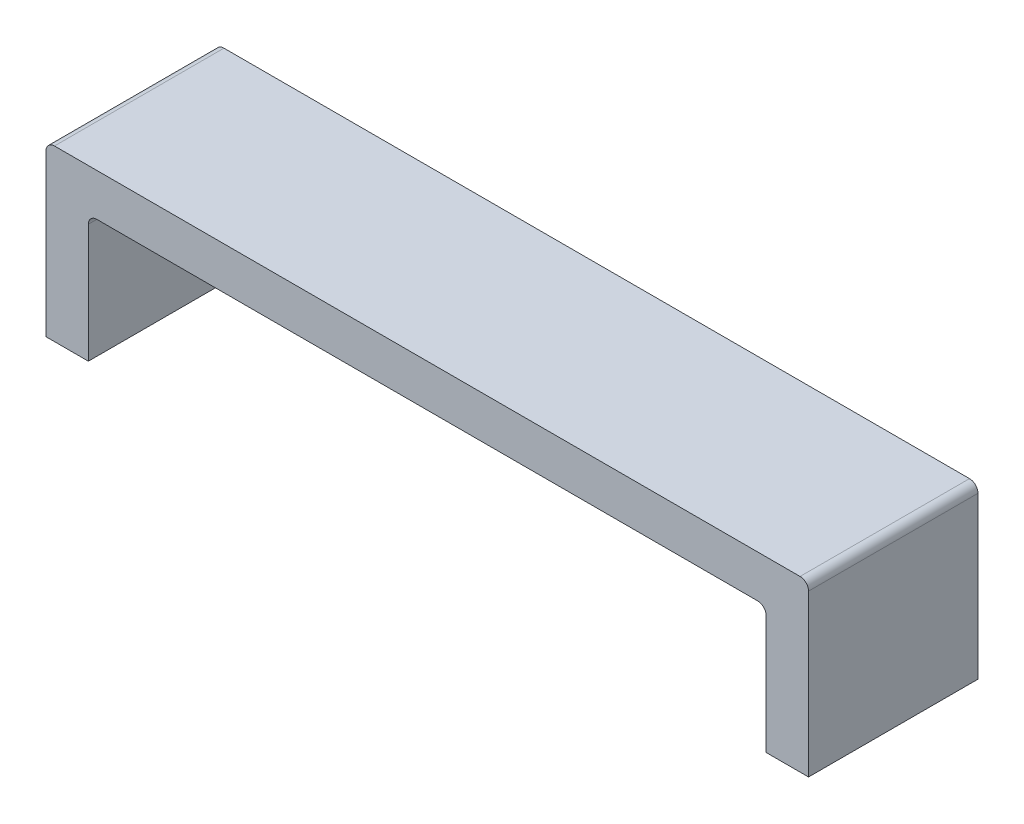
ISO-10303-21;
HEADER;
FILE_DESCRIPTION(('STEP AP214'),'2;1');
FILE_NAME('part.step','',(''),(''),'','','');
FILE_SCHEMA(('AUTOMOTIVE_DESIGN { 1 0 10303 214 1 1 1 1 }'));
ENDSEC;
DATA;
#1=APPLICATION_CONTEXT('core data for automotive mechanical design processes');
#2=APPLICATION_PROTOCOL_DEFINITION('international standard','automotive_design',2000,#1);
#3=PRODUCT_CONTEXT('',#1,'mechanical');
#4=PRODUCT('Part','Part','',(#3));
#5=PRODUCT_RELATED_PRODUCT_CATEGORY('part','',(#4));
#6=PRODUCT_DEFINITION_FORMATION('','',#4);
#7=PRODUCT_DEFINITION_CONTEXT('part definition',#1,'design');
#8=PRODUCT_DEFINITION('design','',#6,#7);
#9=PRODUCT_DEFINITION_SHAPE('','',#8);
#10=(LENGTH_UNIT() NAMED_UNIT(*) SI_UNIT(.MILLI.,.METRE.));
#11=(NAMED_UNIT(*) PLANE_ANGLE_UNIT() SI_UNIT($,.RADIAN.));
#12=(NAMED_UNIT(*) SI_UNIT($,.STERADIAN.) SOLID_ANGLE_UNIT());
#13=UNCERTAINTY_MEASURE_WITH_UNIT(LENGTH_MEASURE(1.E-05),#10,'distance_accuracy_value','');
#14=(GEOMETRIC_REPRESENTATION_CONTEXT(3) GLOBAL_UNCERTAINTY_ASSIGNED_CONTEXT((#13)) GLOBAL_UNIT_ASSIGNED_CONTEXT((#10,
#11,#12)) REPRESENTATION_CONTEXT('',''));
#15=CARTESIAN_POINT('',(0.,0.,0.));
#16=DIRECTION('',(0.,0.,1.));
#17=DIRECTION('',(1.,0.,0.));
#18=AXIS2_PLACEMENT_3D('',#15,#16,#17);
#19=CARTESIAN_POINT('',(25.4,0.,101.6));
#20=DIRECTION('',(0.,1.,0.));
#21=DIRECTION('',(-1.,0.,0.));
#22=AXIS2_PLACEMENT_3D('',#19,#20,#21);
#23=PLANE('',#22);
#24=DIRECTION('',(1.,0.,0.));
#25=VECTOR('',#24,1.);
#26=CARTESIAN_POINT('',(25.4,0.,0.));
#27=LINE('',#26,#25);
#28=CARTESIAN_POINT('',(0.,0.,0.));
#29=VERTEX_POINT('',#28);
#30=CARTESIAN_POINT('',(25.4,0.,0.));
#31=VERTEX_POINT('',#30);
#32=EDGE_CURVE('E161',#29,#31,#27,.T.);
#33=ORIENTED_EDGE('',*,*,#32,.T.);
#34=DIRECTION('',(0.,0.,-1.));
#35=VECTOR('',#34,1.);
#36=CARTESIAN_POINT('',(25.4,0.,101.6));
#37=LINE('',#36,#35);
#38=CARTESIAN_POINT('',(25.4,0.,101.6));
#39=VERTEX_POINT('',#38);
#40=EDGE_CURVE('E142',#39,#31,#37,.T.);
#41=ORIENTED_EDGE('',*,*,#40,.F.);
#42=DIRECTION('',(1.,0.,0.));
#43=VECTOR('',#42,1.);
#44=CARTESIAN_POINT('',(25.4,0.,101.6));
#45=LINE('',#44,#43);
#46=CARTESIAN_POINT('',(0.,0.,101.6));
#47=VERTEX_POINT('',#46);
#48=EDGE_CURVE('E149',#47,#39,#45,.T.);
#49=ORIENTED_EDGE('',*,*,#48,.F.);
#50=DIRECTION('',(0.,0.,-1.));
#51=VECTOR('',#50,1.);
#52=CARTESIAN_POINT('',(0.,0.,101.6));
#53=LINE('',#52,#51);
#54=EDGE_CURVE('E249',#47,#29,#53,.T.);
#55=ORIENTED_EDGE('',*,*,#54,.T.);
#56=EDGE_LOOP('',(#33,#41,#49,#55));
#57=FACE_BOUND('',#56,.T.);
#58=ADVANCED_FACE('F45',(#57),#23,.F.);
#59=CARTESIAN_POINT('',(25.4,76.1999999999999,101.6));
#60=DIRECTION('',(-1.,0.,0.));
#61=DIRECTION('',(0.,-1.,0.));
#62=AXIS2_PLACEMENT_3D('',#59,#60,#61);
#63=PLANE('',#62);
#64=DIRECTION('',(0.,1.,0.));
#65=VECTOR('',#64,1.);
#66=CARTESIAN_POINT('',(25.4,76.1999999999999,0.));
#67=LINE('',#66,#65);
#68=CARTESIAN_POINT('',(25.4,71.1199999999999,0.));
#69=VERTEX_POINT('',#68);
#70=EDGE_CURVE('E218',#31,#69,#67,.T.);
#71=ORIENTED_EDGE('',*,*,#70,.T.);
#72=DIRECTION('',(0.,0.,-1.));
#73=VECTOR('',#72,1.);
#74=CARTESIAN_POINT('',(25.4,71.1199999999999,101.6));
#75=LINE('',#74,#73);
#76=CARTESIAN_POINT('',(25.4,71.1199999999999,101.6));
#77=VERTEX_POINT('',#76);
#78=EDGE_CURVE('E145',#69,#77,#75,.F.);
#79=ORIENTED_EDGE('',*,*,#78,.T.);
#80=DIRECTION('',(0.,1.,0.));
#81=VECTOR('',#80,1.);
#82=CARTESIAN_POINT('',(25.4,76.1999999999999,101.6));
#83=LINE('',#82,#81);
#84=EDGE_CURVE('E137',#39,#77,#83,.T.);
#85=ORIENTED_EDGE('',*,*,#84,.F.);
#86=ORIENTED_EDGE('',*,*,#40,.T.);
#87=EDGE_LOOP('',(#71,#79,#85,#86));
#88=FACE_BOUND('',#87,.T.);
#89=ADVANCED_FACE('F140',(#88),#63,.F.);
#90=CARTESIAN_POINT('',(431.8,76.2,101.6));
#91=DIRECTION('',(0.,1.,0.));
#92=DIRECTION('',(-1.,0.,0.));
#93=AXIS2_PLACEMENT_3D('',#90,#91,#92);
#94=PLANE('',#93);
#95=DIRECTION('',(1.,0.,0.));
#96=VECTOR('',#95,1.);
#97=CARTESIAN_POINT('',(431.8,76.2,0.));
#98=LINE('',#97,#96);
#99=CARTESIAN_POINT('',(30.48,76.1999999999999,0.));
#100=VERTEX_POINT('',#99);
#101=CARTESIAN_POINT('',(426.72,76.2,0.));
#102=VERTEX_POINT('',#101);
#103=EDGE_CURVE('E220',#100,#102,#98,.T.);
#104=ORIENTED_EDGE('',*,*,#103,.T.);
#105=DIRECTION('',(0.,0.,-1.));
#106=VECTOR('',#105,1.);
#107=CARTESIAN_POINT('',(426.72,76.2,101.6));
#108=LINE('',#107,#106);
#109=CARTESIAN_POINT('',(426.72,76.2,101.6));
#110=VERTEX_POINT('',#109);
#111=EDGE_CURVE('E179',#102,#110,#108,.F.);
#112=ORIENTED_EDGE('',*,*,#111,.T.);
#113=DIRECTION('',(1.,0.,0.));
#114=VECTOR('',#113,1.);
#115=CARTESIAN_POINT('',(431.8,76.2,101.6));
#116=LINE('',#115,#114);
#117=CARTESIAN_POINT('',(30.48,76.1999999999999,101.6));
#118=VERTEX_POINT('',#117);
#119=EDGE_CURVE('E148',#118,#110,#116,.T.);
#120=ORIENTED_EDGE('',*,*,#119,.F.);
#121=DIRECTION('',(0.,0.,-1.));
#122=VECTOR('',#121,1.);
#123=CARTESIAN_POINT('',(30.48,76.1999999999999,0.));
#124=LINE('',#123,#122);
#125=EDGE_CURVE('E169',#118,#100,#124,.T.);
#126=ORIENTED_EDGE('',*,*,#125,.T.);
#127=EDGE_LOOP('',(#104,#112,#120,#126));
#128=FACE_BOUND('',#127,.T.);
#129=ADVANCED_FACE('F230',(#128),#94,.F.);
#130=CARTESIAN_POINT('',(431.8,76.2,101.6));
#131=DIRECTION('',(1.,0.,0.));
#132=DIRECTION('',(0.,0.,-1.));
#133=AXIS2_PLACEMENT_3D('',#130,#131,#132);
#134=PLANE('',#133);
#135=DIRECTION('',(0.,-1.,0.));
#136=VECTOR('',#135,1.);
#137=CARTESIAN_POINT('',(431.8,76.2,101.6));
#138=LINE('',#137,#136);
#139=CARTESIAN_POINT('',(431.8,71.12,101.6));
#140=VERTEX_POINT('',#139);
#141=CARTESIAN_POINT('',(431.8,0.,101.6));
#142=VERTEX_POINT('',#141);
#143=EDGE_CURVE('E233',#140,#142,#138,.T.);
#144=ORIENTED_EDGE('',*,*,#143,.F.);
#145=DIRECTION('',(0.,0.,-1.));
#146=VECTOR('',#145,1.);
#147=CARTESIAN_POINT('',(431.8,71.12,0.));
#148=LINE('',#147,#146);
#149=CARTESIAN_POINT('',(431.8,71.12,0.));
#150=VERTEX_POINT('',#149);
#151=EDGE_CURVE('E163',#140,#150,#148,.T.);
#152=ORIENTED_EDGE('',*,*,#151,.T.);
#153=DIRECTION('',(0.,-1.,0.));
#154=VECTOR('',#153,1.);
#155=CARTESIAN_POINT('',(431.8,76.2,0.));
#156=LINE('',#155,#154);
#157=CARTESIAN_POINT('',(431.8,0.,0.));
#158=VERTEX_POINT('',#157);
#159=EDGE_CURVE('E254',#150,#158,#156,.T.);
#160=ORIENTED_EDGE('',*,*,#159,.T.);
#161=DIRECTION('',(0.,0.,-1.));
#162=VECTOR('',#161,1.);
#163=CARTESIAN_POINT('',(431.8,0.,101.6));
#164=LINE('',#163,#162);
#165=EDGE_CURVE('E164',#142,#158,#164,.T.);
#166=ORIENTED_EDGE('',*,*,#165,.F.);
#167=EDGE_LOOP('',(#144,#152,#160,#166));
#168=FACE_BOUND('',#167,.T.);
#169=ADVANCED_FACE('F379',(#168),#134,.F.);
#170=CARTESIAN_POINT('',(431.8,0.,101.6));
#171=DIRECTION('',(0.,1.,0.));
#172=DIRECTION('',(-1.,0.,0.));
#173=AXIS2_PLACEMENT_3D('',#170,#171,#172);
#174=PLANE('',#173);
#175=DIRECTION('',(1.,0.,0.));
#176=VECTOR('',#175,1.);
#177=CARTESIAN_POINT('',(431.8,0.,0.));
#178=LINE('',#177,#176);
#179=CARTESIAN_POINT('',(457.2,0.,0.));
#180=VERTEX_POINT('',#179);
#181=EDGE_CURVE('E257',#158,#180,#178,.T.);
#182=ORIENTED_EDGE('',*,*,#181,.T.);
#183=DIRECTION('',(0.,0.,-1.));
#184=VECTOR('',#183,1.);
#185=CARTESIAN_POINT('',(457.2,0.,101.6));
#186=LINE('',#185,#184);
#187=CARTESIAN_POINT('',(457.2,0.,101.6));
#188=VERTEX_POINT('',#187);
#189=EDGE_CURVE('E172',#188,#180,#186,.T.);
#190=ORIENTED_EDGE('',*,*,#189,.F.);
#191=DIRECTION('',(1.,0.,0.));
#192=VECTOR('',#191,1.);
#193=CARTESIAN_POINT('',(431.8,0.,101.6));
#194=LINE('',#193,#192);
#195=EDGE_CURVE('E236',#142,#188,#194,.T.);
#196=ORIENTED_EDGE('',*,*,#195,.F.);
#197=ORIENTED_EDGE('',*,*,#165,.T.);
#198=EDGE_LOOP('',(#182,#190,#196,#197));
#199=FACE_BOUND('',#198,.T.);
#200=ADVANCED_FACE('F370',(#199),#174,.F.);
#201=CARTESIAN_POINT('',(457.2,0.,101.6));
#202=DIRECTION('',(-1.,0.,0.));
#203=DIRECTION('',(0.,0.,1.));
#204=AXIS2_PLACEMENT_3D('',#201,#202,#203);
#205=PLANE('',#204);
#206=DIRECTION('',(0.,1.,0.));
#207=VECTOR('',#206,1.);
#208=CARTESIAN_POINT('',(457.2,0.,0.));
#209=LINE('',#208,#207);
#210=CARTESIAN_POINT('',(457.2,96.52,0.));
#211=VERTEX_POINT('',#210);
#212=EDGE_CURVE('E260',#180,#211,#209,.T.);
#213=ORIENTED_EDGE('',*,*,#212,.T.);
#214=DIRECTION('',(0.,0.,-1.));
#215=VECTOR('',#214,1.);
#216=CARTESIAN_POINT('',(457.2,96.52,101.6));
#217=LINE('',#216,#215);
#218=CARTESIAN_POINT('',(457.2,96.52,101.6));
#219=VERTEX_POINT('',#218);
#220=EDGE_CURVE('E69',#211,#219,#217,.F.);
#221=ORIENTED_EDGE('',*,*,#220,.T.);
#222=DIRECTION('',(0.,1.,0.));
#223=VECTOR('',#222,1.);
#224=CARTESIAN_POINT('',(457.2,0.,101.6));
#225=LINE('',#224,#223);
#226=EDGE_CURVE('E241',#188,#219,#225,.T.);
#227=ORIENTED_EDGE('',*,*,#226,.F.);
#228=ORIENTED_EDGE('',*,*,#189,.T.);
#229=EDGE_LOOP('',(#213,#221,#227,#228));
#230=FACE_BOUND('',#229,.T.);
#231=ADVANCED_FACE('F274',(#230),#205,.F.);
#232=CARTESIAN_POINT('',(0.,101.6,101.6));
#233=DIRECTION('',(0.,-1.,0.));
#234=DIRECTION('',(0.,0.,-1.));
#235=AXIS2_PLACEMENT_3D('',#232,#233,#234);
#236=PLANE('',#235);
#237=DIRECTION('',(-1.,0.,0.));
#238=VECTOR('',#237,1.);
#239=CARTESIAN_POINT('',(0.,101.6,101.6));
#240=LINE('',#239,#238);
#241=CARTESIAN_POINT('',(452.12,101.6,101.6));
#242=VERTEX_POINT('',#241);
#243=CARTESIAN_POINT('',(5.08,101.6,101.6));
#244=VERTEX_POINT('',#243);
#245=EDGE_CURVE('E244',#242,#244,#240,.T.);
#246=ORIENTED_EDGE('',*,*,#245,.F.);
#247=DIRECTION('',(0.,0.,-1.));
#248=VECTOR('',#247,1.);
#249=CARTESIAN_POINT('',(452.12,101.6,101.6));
#250=LINE('',#249,#248);
#251=CARTESIAN_POINT('',(452.12,101.6,0.));
#252=VERTEX_POINT('',#251);
#253=EDGE_CURVE('E187',#242,#252,#250,.T.);
#254=ORIENTED_EDGE('',*,*,#253,.T.);
#255=DIRECTION('',(-1.,0.,0.));
#256=VECTOR('',#255,1.);
#257=CARTESIAN_POINT('',(0.,101.6,0.));
#258=LINE('',#257,#256);
#259=CARTESIAN_POINT('',(5.08,101.6,0.));
#260=VERTEX_POINT('',#259);
#261=EDGE_CURVE('E263',#252,#260,#258,.T.);
#262=ORIENTED_EDGE('',*,*,#261,.T.);
#263=DIRECTION('',(0.,0.,-1.));
#264=VECTOR('',#263,1.);
#265=CARTESIAN_POINT('',(5.08,101.6,101.6));
#266=LINE('',#265,#264);
#267=EDGE_CURVE('E184',#260,#244,#266,.F.);
#268=ORIENTED_EDGE('',*,*,#267,.T.);
#269=EDGE_LOOP('',(#246,#254,#262,#268));
#270=FACE_BOUND('',#269,.T.);
#271=ADVANCED_FACE('F285',(#270),#236,.F.);
#272=CARTESIAN_POINT('',(0.,0.,101.6));
#273=DIRECTION('',(1.,0.,0.));
#274=DIRECTION('',(0.,0.,-1.));
#275=AXIS2_PLACEMENT_3D('',#272,#273,#274);
#276=PLANE('',#275);
#277=DIRECTION('',(0.,-1.,0.));
#278=VECTOR('',#277,1.);
#279=CARTESIAN_POINT('',(0.,0.,101.6));
#280=LINE('',#279,#278);
#281=CARTESIAN_POINT('',(0.,96.52,101.6));
#282=VERTEX_POINT('',#281);
#283=EDGE_CURVE('E153',#282,#47,#280,.T.);
#284=ORIENTED_EDGE('',*,*,#283,.F.);
#285=DIRECTION('',(0.,0.,-1.));
#286=VECTOR('',#285,1.);
#287=CARTESIAN_POINT('',(0.,96.52,101.6));
#288=LINE('',#287,#286);
#289=CARTESIAN_POINT('',(0.,96.52,0.));
#290=VERTEX_POINT('',#289);
#291=EDGE_CURVE('E204',#282,#290,#288,.T.);
#292=ORIENTED_EDGE('',*,*,#291,.T.);
#293=DIRECTION('',(0.,-1.,0.));
#294=VECTOR('',#293,1.);
#295=CARTESIAN_POINT('',(0.,0.,0.));
#296=LINE('',#295,#294);
#297=EDGE_CURVE('E158',#290,#29,#296,.T.);
#298=ORIENTED_EDGE('',*,*,#297,.T.);
#299=ORIENTED_EDGE('',*,*,#54,.F.);
#300=EDGE_LOOP('',(#284,#292,#298,#299));
#301=FACE_BOUND('',#300,.T.);
#302=ADVANCED_FACE('F291',(#301),#276,.F.);
#303=CARTESIAN_POINT('',(0.,0.,101.6));
#304=DIRECTION('',(0.,0.,-1.));
#305=DIRECTION('',(-1.,0.,0.));
#306=AXIS2_PLACEMENT_3D('',#303,#304,#305);
#307=PLANE('',#306);
#308=ORIENTED_EDGE('',*,*,#226,.T.);
#309=CARTESIAN_POINT('',(452.12,96.52,101.6));
#310=DIRECTION('',(0.,0.,-1.));
#311=DIRECTION('',(-1.,0.,0.));
#312=AXIS2_PLACEMENT_3D('',#309,#310,#311);
#313=CIRCLE('',#312,5.08);
#314=EDGE_CURVE('E201',#219,#242,#313,.F.);
#315=ORIENTED_EDGE('',*,*,#314,.T.);
#316=ORIENTED_EDGE('',*,*,#245,.T.);
#317=CARTESIAN_POINT('',(5.08,96.52,101.6));
#318=DIRECTION('',(0.,0.,-1.));
#319=DIRECTION('',(-1.,0.,0.));
#320=AXIS2_PLACEMENT_3D('',#317,#318,#319);
#321=CIRCLE('',#320,5.08);
#322=EDGE_CURVE('E61',#244,#282,#321,.F.);
#323=ORIENTED_EDGE('',*,*,#322,.T.);
#324=ORIENTED_EDGE('',*,*,#283,.T.);
#325=ORIENTED_EDGE('',*,*,#48,.T.);
#326=ORIENTED_EDGE('',*,*,#84,.T.);
#327=CARTESIAN_POINT('',(30.48,71.1199999999999,101.6));
#328=DIRECTION('',(0.,0.,-1.));
#329=DIRECTION('',(-1.,0.,0.));
#330=AXIS2_PLACEMENT_3D('',#327,#328,#329);
#331=CIRCLE('',#330,5.08);
#332=EDGE_CURVE('E11',#77,#118,#331,.T.);
#333=ORIENTED_EDGE('',*,*,#332,.T.);
#334=ORIENTED_EDGE('',*,*,#119,.T.);
#335=CARTESIAN_POINT('',(426.72,71.12,101.6));
#336=DIRECTION('',(0.,0.,-1.));
#337=DIRECTION('',(-1.,0.,0.));
#338=AXIS2_PLACEMENT_3D('',#335,#336,#337);
#339=CIRCLE('',#338,5.08);
#340=EDGE_CURVE('E211',#110,#140,#339,.T.);
#341=ORIENTED_EDGE('',*,*,#340,.T.);
#342=ORIENTED_EDGE('',*,*,#143,.T.);
#343=ORIENTED_EDGE('',*,*,#195,.T.);
#344=EDGE_LOOP('',(#308,#315,#316,#323,#324,#325,#326,#333,#334,#341,#342,#343));
#345=FACE_BOUND('',#344,.T.);
#346=ADVANCED_FACE('F152',(#345),#307,.F.);
#347=CARTESIAN_POINT('',(0.,0.,0.));
#348=DIRECTION('',(0.,0.,-1.));
#349=DIRECTION('',(-1.,0.,0.));
#350=AXIS2_PLACEMENT_3D('',#347,#348,#349);
#351=PLANE('',#350);
#352=ORIENTED_EDGE('',*,*,#261,.F.);
#353=CARTESIAN_POINT('',(452.12,96.52,0.));
#354=DIRECTION('',(0.,0.,-1.));
#355=DIRECTION('',(-1.,0.,0.));
#356=AXIS2_PLACEMENT_3D('',#353,#354,#355);
#357=CIRCLE('',#356,5.08);
#358=EDGE_CURVE('E194',#252,#211,#357,.T.);
#359=ORIENTED_EDGE('',*,*,#358,.T.);
#360=ORIENTED_EDGE('',*,*,#212,.F.);
#361=ORIENTED_EDGE('',*,*,#181,.F.);
#362=ORIENTED_EDGE('',*,*,#159,.F.);
#363=CARTESIAN_POINT('',(426.72,71.12,0.));
#364=DIRECTION('',(0.,0.,-1.));
#365=DIRECTION('',(-1.,0.,0.));
#366=AXIS2_PLACEMENT_3D('',#363,#364,#365);
#367=CIRCLE('',#366,5.08);
#368=EDGE_CURVE('E208',#150,#102,#367,.F.);
#369=ORIENTED_EDGE('',*,*,#368,.T.);
#370=ORIENTED_EDGE('',*,*,#103,.F.);
#371=CARTESIAN_POINT('',(30.48,71.1199999999999,0.));
#372=DIRECTION('',(0.,0.,-1.));
#373=DIRECTION('',(-1.,0.,0.));
#374=AXIS2_PLACEMENT_3D('',#371,#372,#373);
#375=CIRCLE('',#374,5.08);
#376=EDGE_CURVE('E54',#100,#69,#375,.F.);
#377=ORIENTED_EDGE('',*,*,#376,.T.);
#378=ORIENTED_EDGE('',*,*,#70,.F.);
#379=ORIENTED_EDGE('',*,*,#32,.F.);
#380=ORIENTED_EDGE('',*,*,#297,.F.);
#381=CARTESIAN_POINT('',(5.08,96.52,0.));
#382=DIRECTION('',(0.,0.,-1.));
#383=DIRECTION('',(-1.,0.,0.));
#384=AXIS2_PLACEMENT_3D('',#381,#382,#383);
#385=CIRCLE('',#384,5.08);
#386=EDGE_CURVE('E191',#290,#260,#385,.T.);
#387=ORIENTED_EDGE('',*,*,#386,.T.);
#388=EDGE_LOOP('',(#352,#359,#360,#361,#362,#369,#370,#377,#378,#379,#380,#387));
#389=FACE_BOUND('',#388,.T.);
#390=ADVANCED_FACE('F217',(#389),#351,.T.);
#391=CARTESIAN_POINT('',(426.72,71.12,101.6));
#392=DIRECTION('',(0.,0.,1.));
#393=DIRECTION('',(1.,0.,0.));
#394=AXIS2_PLACEMENT_3D('',#391,#392,#393);
#395=CYLINDRICAL_SURFACE('',#394,5.08);
#396=ORIENTED_EDGE('',*,*,#340,.F.);
#397=ORIENTED_EDGE('',*,*,#111,.F.);
#398=ORIENTED_EDGE('',*,*,#368,.F.);
#399=ORIENTED_EDGE('',*,*,#151,.F.);
#400=EDGE_LOOP('',(#396,#397,#398,#399));
#401=FACE_BOUND('',#400,.T.);
#402=ADVANCED_FACE('F310',(#401),#395,.F.);
#403=CARTESIAN_POINT('',(30.48,71.1199999999999,101.6));
#404=DIRECTION('',(0.,0.,1.));
#405=DIRECTION('',(1.,0.,0.));
#406=AXIS2_PLACEMENT_3D('',#403,#404,#405);
#407=CYLINDRICAL_SURFACE('',#406,5.08);
#408=ORIENTED_EDGE('',*,*,#332,.F.);
#409=ORIENTED_EDGE('',*,*,#78,.F.);
#410=ORIENTED_EDGE('',*,*,#376,.F.);
#411=ORIENTED_EDGE('',*,*,#125,.F.);
#412=EDGE_LOOP('',(#408,#409,#410,#411));
#413=FACE_BOUND('',#412,.T.);
#414=ADVANCED_FACE('F225',(#413),#407,.F.);
#415=CARTESIAN_POINT('',(452.12,96.52,101.6));
#416=DIRECTION('',(0.,0.,-1.));
#417=DIRECTION('',(-1.,0.,0.));
#418=AXIS2_PLACEMENT_3D('',#415,#416,#417);
#419=CYLINDRICAL_SURFACE('',#418,5.08);
#420=ORIENTED_EDGE('',*,*,#314,.F.);
#421=ORIENTED_EDGE('',*,*,#220,.F.);
#422=ORIENTED_EDGE('',*,*,#358,.F.);
#423=ORIENTED_EDGE('',*,*,#253,.F.);
#424=EDGE_LOOP('',(#420,#421,#422,#423));
#425=FACE_BOUND('',#424,.T.);
#426=ADVANCED_FACE('F282',(#425),#419,.T.);
#427=CARTESIAN_POINT('',(5.08,96.52,101.6));
#428=DIRECTION('',(0.,0.,-1.));
#429=DIRECTION('',(-1.,0.,0.));
#430=AXIS2_PLACEMENT_3D('',#427,#428,#429);
#431=CYLINDRICAL_SURFACE('',#430,5.08);
#432=ORIENTED_EDGE('',*,*,#322,.F.);
#433=ORIENTED_EDGE('',*,*,#267,.F.);
#434=ORIENTED_EDGE('',*,*,#386,.F.);
#435=ORIENTED_EDGE('',*,*,#291,.F.);
#436=EDGE_LOOP('',(#432,#433,#434,#435));
#437=FACE_BOUND('',#436,.T.);
#438=ADVANCED_FACE('F47',(#437),#431,.T.);
#439=CLOSED_SHELL('',(#58,#89,#129,#169,#200,#231,#271,#302,#346,#390,#402,#414,#426,#438));
#440=MANIFOLD_SOLID_BREP('B2',#439);
#441=ADVANCED_BREP_SHAPE_REPRESENTATION('',(#18,#440),#14);
#442=SHAPE_DEFINITION_REPRESENTATION(#9,#441);
ENDSEC;
END-ISO-10303-21;
